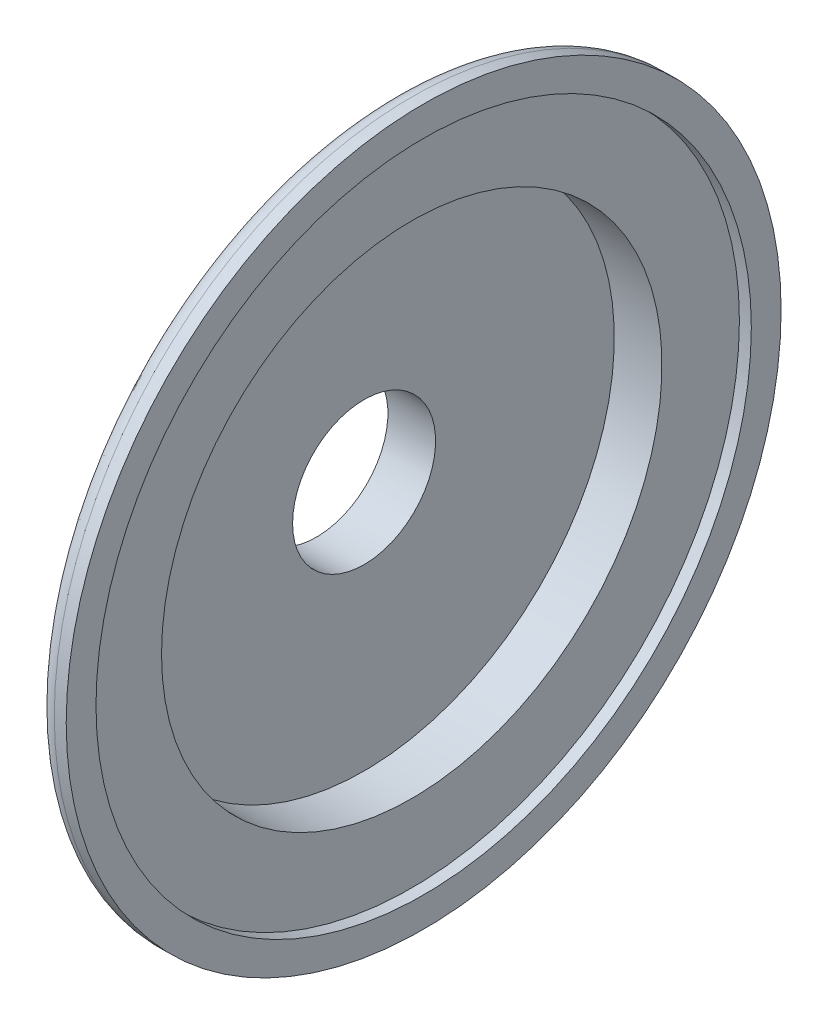
ISO-10303-21;
HEADER;
FILE_DESCRIPTION(('STEP AP214'),'2;1');
FILE_NAME('part.step','',(''),(''),'','','');
FILE_SCHEMA(('AUTOMOTIVE_DESIGN { 1 0 10303 214 1 1 1 1 }'));
ENDSEC;
DATA;
#1=APPLICATION_CONTEXT('core data for automotive mechanical design processes');
#2=APPLICATION_PROTOCOL_DEFINITION('international standard','automotive_design',2000,#1);
#3=PRODUCT_CONTEXT('',#1,'mechanical');
#4=PRODUCT('Part','Part','',(#3));
#5=PRODUCT_RELATED_PRODUCT_CATEGORY('part','',(#4));
#6=PRODUCT_DEFINITION_FORMATION('','',#4);
#7=PRODUCT_DEFINITION_CONTEXT('part definition',#1,'design');
#8=PRODUCT_DEFINITION('design','',#6,#7);
#9=PRODUCT_DEFINITION_SHAPE('','',#8);
#10=(LENGTH_UNIT() NAMED_UNIT(*) SI_UNIT(.MILLI.,.METRE.));
#11=(NAMED_UNIT(*) PLANE_ANGLE_UNIT() SI_UNIT($,.RADIAN.));
#12=(NAMED_UNIT(*) SI_UNIT($,.STERADIAN.) SOLID_ANGLE_UNIT());
#13=UNCERTAINTY_MEASURE_WITH_UNIT(LENGTH_MEASURE(1.E-05),#10,'distance_accuracy_value','');
#14=(GEOMETRIC_REPRESENTATION_CONTEXT(3) GLOBAL_UNCERTAINTY_ASSIGNED_CONTEXT((#13)) GLOBAL_UNIT_ASSIGNED_CONTEXT((#10,
#11,#12)) REPRESENTATION_CONTEXT('',''));
#15=CARTESIAN_POINT('',(0.,0.,0.));
#16=DIRECTION('',(0.,0.,1.));
#17=DIRECTION('',(1.,0.,0.));
#18=AXIS2_PLACEMENT_3D('',#15,#16,#17);
#19=CARTESIAN_POINT('',(9.,55.,0.));
#20=DIRECTION('',(-1.,0.,0.));
#21=DIRECTION('',(0.,0.,1.));
#22=AXIS2_PLACEMENT_3D('',#19,#20,#21);
#23=PLANE('',#22);
#24=CARTESIAN_POINT('',(9.,0.,0.));
#25=DIRECTION('',(-1.,0.,0.));
#26=DIRECTION('',(0.,0.,1.));
#27=AXIS2_PLACEMENT_3D('',#24,#25,#26);
#28=CIRCLE('',#27,60.);
#29=CARTESIAN_POINT('',(9.,0.,60.));
#30=VERTEX_POINT('',#29);
#31=EDGE_CURVE('E58',#30,#30,#28,.T.);
#32=ORIENTED_EDGE('',*,*,#31,.F.);
#33=EDGE_LOOP('',(#32));
#34=FACE_BOUND('',#33,.T.);
#35=CARTESIAN_POINT('',(9.,0.,0.));
#36=DIRECTION('',(-1.,0.,0.));
#37=DIRECTION('',(0.,0.,1.));
#38=AXIS2_PLACEMENT_3D('',#35,#36,#37);
#39=CIRCLE('',#38,55.);
#40=CARTESIAN_POINT('',(9.,0.,55.));
#41=VERTEX_POINT('',#40);
#42=EDGE_CURVE('E82',#41,#41,#39,.T.);
#43=ORIENTED_EDGE('',*,*,#42,.T.);
#44=EDGE_LOOP('',(#43));
#45=FACE_BOUND('',#44,.T.);
#46=ADVANCED_FACE('F35',(#34,#45),#23,.F.);
#47=CARTESIAN_POINT('',(-9.,0.,0.));
#48=DIRECTION('',(-1.,0.,0.));
#49=DIRECTION('',(0.,0.,1.));
#50=AXIS2_PLACEMENT_3D('',#47,#48,#49);
#51=CYLINDRICAL_SURFACE('',#50,60.);
#52=CARTESIAN_POINT('',(7.,0.,0.));
#53=DIRECTION('',(1.,0.,0.));
#54=DIRECTION('',(0.,0.,-1.));
#55=AXIS2_PLACEMENT_3D('',#52,#53,#54);
#56=CIRCLE('',#55,60.);
#57=CARTESIAN_POINT('',(7.,0.,-60.));
#58=VERTEX_POINT('',#57);
#59=EDGE_CURVE('E10',#58,#58,#56,.T.);
#60=ORIENTED_EDGE('',*,*,#59,.T.);
#61=EDGE_LOOP('',(#60));
#62=FACE_BOUND('',#61,.T.);
#63=ORIENTED_EDGE('',*,*,#31,.T.);
#64=EDGE_LOOP('',(#63));
#65=FACE_BOUND('',#64,.T.);
#66=ADVANCED_FACE('F130',(#62,#65),#51,.T.);
#67=CARTESIAN_POINT('',(4.,60.,0.));
#68=DIRECTION('',(1.,0.,0.));
#69=DIRECTION('',(0.,0.,-1.));
#70=AXIS2_PLACEMENT_3D('',#67,#68,#69);
#71=PLANE('',#70);
#72=CARTESIAN_POINT('',(4.,0.,0.));
#73=DIRECTION('',(1.,0.,0.));
#74=DIRECTION('',(0.,0.,-1.));
#75=AXIS2_PLACEMENT_3D('',#72,#73,#74);
#76=CIRCLE('',#75,57.);
#77=CARTESIAN_POINT('',(4.,0.,-57.));
#78=VERTEX_POINT('',#77);
#79=EDGE_CURVE('E42',#78,#78,#76,.F.);
#80=ORIENTED_EDGE('',*,*,#79,.T.);
#81=EDGE_LOOP('',(#80));
#82=FACE_BOUND('',#81,.T.);
#83=CARTESIAN_POINT('',(4.00000000000001,0.,0.));
#84=DIRECTION('',(-1.,0.,0.));
#85=DIRECTION('',(0.,0.,1.));
#86=AXIS2_PLACEMENT_3D('',#83,#84,#85);
#87=CIRCLE('',#86,45.);
#88=CARTESIAN_POINT('',(4.00000000000001,0.,45.));
#89=VERTEX_POINT('',#88);
#90=EDGE_CURVE('E61',#89,#89,#87,.T.);
#91=ORIENTED_EDGE('',*,*,#90,.F.);
#92=EDGE_LOOP('',(#91));
#93=FACE_BOUND('',#92,.T.);
#94=ADVANCED_FACE('F135',(#82,#93),#71,.F.);
#95=CARTESIAN_POINT('',(-9.,0.,0.));
#96=DIRECTION('',(-1.,0.,0.));
#97=DIRECTION('',(0.,0.,1.));
#98=AXIS2_PLACEMENT_3D('',#95,#96,#97);
#99=CYLINDRICAL_SURFACE('',#98,45.);
#100=CARTESIAN_POINT('',(-0.999999999999992,0.,0.));
#101=DIRECTION('',(1.,0.,0.));
#102=DIRECTION('',(0.,0.,-1.));
#103=AXIS2_PLACEMENT_3D('',#100,#101,#102);
#104=CIRCLE('',#103,45.);
#105=CARTESIAN_POINT('',(-0.999999999999992,0.,-45.));
#106=VERTEX_POINT('',#105);
#107=EDGE_CURVE('E46',#106,#106,#104,.T.);
#108=ORIENTED_EDGE('',*,*,#107,.T.);
#109=EDGE_LOOP('',(#108));
#110=FACE_BOUND('',#109,.T.);
#111=ORIENTED_EDGE('',*,*,#90,.T.);
#112=EDGE_LOOP('',(#111));
#113=FACE_BOUND('',#112,.T.);
#114=ADVANCED_FACE('F141',(#110,#113),#99,.T.);
#115=CARTESIAN_POINT('',(-3.99999999999999,45.,0.));
#116=DIRECTION('',(1.,0.,0.));
#117=DIRECTION('',(0.,0.,-1.));
#118=AXIS2_PLACEMENT_3D('',#115,#116,#117);
#119=PLANE('',#118);
#120=CARTESIAN_POINT('',(-3.99999999999999,0.,0.));
#121=DIRECTION('',(1.,0.,0.));
#122=DIRECTION('',(0.,0.,-1.));
#123=AXIS2_PLACEMENT_3D('',#120,#121,#122);
#124=CIRCLE('',#123,42.);
#125=CARTESIAN_POINT('',(-3.99999999999999,0.,-42.));
#126=VERTEX_POINT('',#125);
#127=EDGE_CURVE('E50',#126,#126,#124,.F.);
#128=ORIENTED_EDGE('',*,*,#127,.T.);
#129=EDGE_LOOP('',(#128));
#130=FACE_BOUND('',#129,.T.);
#131=CARTESIAN_POINT('',(-3.99999999999999,0.,0.));
#132=DIRECTION('',(-1.,0.,0.));
#133=DIRECTION('',(0.,0.,1.));
#134=AXIS2_PLACEMENT_3D('',#131,#132,#133);
#135=CIRCLE('',#134,15.);
#136=CARTESIAN_POINT('',(-3.99999999999999,0.,15.));
#137=VERTEX_POINT('',#136);
#138=EDGE_CURVE('E64',#137,#137,#135,.T.);
#139=ORIENTED_EDGE('',*,*,#138,.F.);
#140=EDGE_LOOP('',(#139));
#141=FACE_BOUND('',#140,.T.);
#142=ADVANCED_FACE('F144',(#130,#141),#119,.F.);
#143=CARTESIAN_POINT('',(-9.,0.,0.));
#144=DIRECTION('',(-1.,0.,0.));
#145=DIRECTION('',(0.,0.,1.));
#146=AXIS2_PLACEMENT_3D('',#143,#144,#145);
#147=CYLINDRICAL_SURFACE('',#146,15.);
#148=CARTESIAN_POINT('',(-6.,0.,0.));
#149=DIRECTION('',(1.,0.,0.));
#150=DIRECTION('',(0.,0.,-1.));
#151=AXIS2_PLACEMENT_3D('',#148,#149,#150);
#152=CIRCLE('',#151,15.);
#153=CARTESIAN_POINT('',(-6.,0.,-15.));
#154=VERTEX_POINT('',#153);
#155=EDGE_CURVE('E55',#154,#154,#152,.T.);
#156=ORIENTED_EDGE('',*,*,#155,.T.);
#157=EDGE_LOOP('',(#156));
#158=FACE_BOUND('',#157,.T.);
#159=ORIENTED_EDGE('',*,*,#138,.T.);
#160=EDGE_LOOP('',(#159));
#161=FACE_BOUND('',#160,.T.);
#162=ADVANCED_FACE('F115',(#158,#161),#147,.T.);
#163=CARTESIAN_POINT('',(-9.,0.,0.));
#164=DIRECTION('',(-1.,0.,0.));
#165=DIRECTION('',(0.,0.,1.));
#166=AXIS2_PLACEMENT_3D('',#163,#164,#165);
#167=CYLINDRICAL_SURFACE('',#166,12.);
#168=CARTESIAN_POINT('',(-0.999999999999992,0.,0.));
#169=DIRECTION('',(-1.,0.,0.));
#170=DIRECTION('',(0.,0.,1.));
#171=AXIS2_PLACEMENT_3D('',#168,#169,#170);
#172=CIRCLE('',#171,12.);
#173=CARTESIAN_POINT('',(-0.999999999999992,0.,12.));
#174=VERTEX_POINT('',#173);
#175=EDGE_CURVE('E70',#174,#174,#172,.T.);
#176=ORIENTED_EDGE('',*,*,#175,.F.);
#177=EDGE_LOOP('',(#176));
#178=FACE_BOUND('',#177,.T.);
#179=CARTESIAN_POINT('',(-9.,0.,0.));
#180=DIRECTION('',(-1.,0.,0.));
#181=DIRECTION('',(0.,0.,1.));
#182=AXIS2_PLACEMENT_3D('',#179,#180,#181);
#183=CIRCLE('',#182,12.);
#184=CARTESIAN_POINT('',(-9.,0.,12.));
#185=VERTEX_POINT('',#184);
#186=EDGE_CURVE('E67',#185,#185,#183,.T.);
#187=ORIENTED_EDGE('',*,*,#186,.T.);
#188=EDGE_LOOP('',(#187));
#189=FACE_BOUND('',#188,.T.);
#190=ADVANCED_FACE('F109',(#178,#189),#167,.F.);
#191=CARTESIAN_POINT('',(-0.999999999999992,12.,0.));
#192=DIRECTION('',(-1.,0.,0.));
#193=DIRECTION('',(0.,0.,1.));
#194=AXIS2_PLACEMENT_3D('',#191,#192,#193);
#195=PLANE('',#194);
#196=CARTESIAN_POINT('',(-0.999999999999992,0.,0.));
#197=DIRECTION('',(-1.,0.,0.));
#198=DIRECTION('',(0.,0.,1.));
#199=AXIS2_PLACEMENT_3D('',#196,#197,#198);
#200=CIRCLE('',#199,42.);
#201=CARTESIAN_POINT('',(-0.999999999999992,0.,42.));
#202=VERTEX_POINT('',#201);
#203=EDGE_CURVE('E73',#202,#202,#200,.T.);
#204=ORIENTED_EDGE('',*,*,#203,.F.);
#205=EDGE_LOOP('',(#204));
#206=FACE_BOUND('',#205,.T.);
#207=ORIENTED_EDGE('',*,*,#175,.T.);
#208=EDGE_LOOP('',(#207));
#209=FACE_BOUND('',#208,.T.);
#210=ADVANCED_FACE('F103',(#206,#209),#195,.F.);
#211=CARTESIAN_POINT('',(-9.,0.,0.));
#212=DIRECTION('',(-1.,0.,0.));
#213=DIRECTION('',(0.,0.,1.));
#214=AXIS2_PLACEMENT_3D('',#211,#212,#213);
#215=CYLINDRICAL_SURFACE('',#214,42.);
#216=CARTESIAN_POINT('',(7.,0.,0.));
#217=DIRECTION('',(-1.,0.,0.));
#218=DIRECTION('',(0.,0.,1.));
#219=AXIS2_PLACEMENT_3D('',#216,#217,#218);
#220=CIRCLE('',#219,42.);
#221=CARTESIAN_POINT('',(7.,0.,42.));
#222=VERTEX_POINT('',#221);
#223=EDGE_CURVE('E76',#222,#222,#220,.T.);
#224=ORIENTED_EDGE('',*,*,#223,.F.);
#225=EDGE_LOOP('',(#224));
#226=FACE_BOUND('',#225,.T.);
#227=ORIENTED_EDGE('',*,*,#203,.T.);
#228=EDGE_LOOP('',(#227));
#229=FACE_BOUND('',#228,.T.);
#230=ADVANCED_FACE('F97',(#226,#229),#215,.F.);
#231=CARTESIAN_POINT('',(7.,42.,0.));
#232=DIRECTION('',(-1.,0.,0.));
#233=DIRECTION('',(0.,0.,1.));
#234=AXIS2_PLACEMENT_3D('',#231,#232,#233);
#235=PLANE('',#234);
#236=CARTESIAN_POINT('',(7.,0.,0.));
#237=DIRECTION('',(-1.,0.,0.));
#238=DIRECTION('',(0.,0.,1.));
#239=AXIS2_PLACEMENT_3D('',#236,#237,#238);
#240=CIRCLE('',#239,55.);
#241=CARTESIAN_POINT('',(7.,0.,55.));
#242=VERTEX_POINT('',#241);
#243=EDGE_CURVE('E79',#242,#242,#240,.T.);
#244=ORIENTED_EDGE('',*,*,#243,.F.);
#245=EDGE_LOOP('',(#244));
#246=FACE_BOUND('',#245,.T.);
#247=ORIENTED_EDGE('',*,*,#223,.T.);
#248=EDGE_LOOP('',(#247));
#249=FACE_BOUND('',#248,.T.);
#250=ADVANCED_FACE('F91',(#246,#249),#235,.F.);
#251=CARTESIAN_POINT('',(-9.,0.,0.));
#252=DIRECTION('',(-1.,0.,0.));
#253=DIRECTION('',(0.,0.,1.));
#254=AXIS2_PLACEMENT_3D('',#251,#252,#253);
#255=CYLINDRICAL_SURFACE('',#254,55.);
#256=ORIENTED_EDGE('',*,*,#42,.F.);
#257=EDGE_LOOP('',(#256));
#258=FACE_BOUND('',#257,.T.);
#259=ORIENTED_EDGE('',*,*,#243,.T.);
#260=EDGE_LOOP('',(#259));
#261=FACE_BOUND('',#260,.T.);
#262=ADVANCED_FACE('F87',(#258,#261),#255,.F.);
#263=CARTESIAN_POINT('',(-6.,0.,0.));
#264=DIRECTION('',(1.,0.,0.));
#265=DIRECTION('',(0.,0.,-1.));
#266=AXIS2_PLACEMENT_3D('',#263,#264,#265);
#267=TOROIDAL_SURFACE('',#266,12.,3.);
#268=ORIENTED_EDGE('',*,*,#155,.F.);
#269=EDGE_LOOP('',(#268));
#270=FACE_BOUND('',#269,.T.);
#271=ORIENTED_EDGE('',*,*,#186,.F.);
#272=EDGE_LOOP('',(#271));
#273=FACE_BOUND('',#272,.T.);
#274=ADVANCED_FACE('F90',(#270,#273),#267,.T.);
#275=CARTESIAN_POINT('',(-0.999999999999992,0.,0.));
#276=DIRECTION('',(1.,0.,0.));
#277=DIRECTION('',(0.,0.,-1.));
#278=AXIS2_PLACEMENT_3D('',#275,#276,#277);
#279=TOROIDAL_SURFACE('',#278,42.,3.);
#280=ORIENTED_EDGE('',*,*,#107,.F.);
#281=EDGE_LOOP('',(#280));
#282=FACE_BOUND('',#281,.T.);
#283=ORIENTED_EDGE('',*,*,#127,.F.);
#284=EDGE_LOOP('',(#283));
#285=FACE_BOUND('',#284,.T.);
#286=ADVANCED_FACE('F120',(#282,#285),#279,.T.);
#287=CARTESIAN_POINT('',(7.,0.,0.));
#288=DIRECTION('',(1.,0.,0.));
#289=DIRECTION('',(0.,0.,-1.));
#290=AXIS2_PLACEMENT_3D('',#287,#288,#289);
#291=TOROIDAL_SURFACE('',#290,57.,3.);
#292=ORIENTED_EDGE('',*,*,#59,.F.);
#293=EDGE_LOOP('',(#292));
#294=FACE_BOUND('',#293,.T.);
#295=ORIENTED_EDGE('',*,*,#79,.F.);
#296=EDGE_LOOP('',(#295));
#297=FACE_BOUND('',#296,.T.);
#298=ADVANCED_FACE('F37',(#294,#297),#291,.T.);
#299=CLOSED_SHELL('',(#46,#66,#94,#114,#142,#162,#190,#210,#230,#250,#262,#274,#286,#298));
#300=MANIFOLD_SOLID_BREP('B2',#299);
#301=ADVANCED_BREP_SHAPE_REPRESENTATION('',(#18,#300),#14);
#302=SHAPE_DEFINITION_REPRESENTATION(#9,#301);
ENDSEC;
END-ISO-10303-21;
